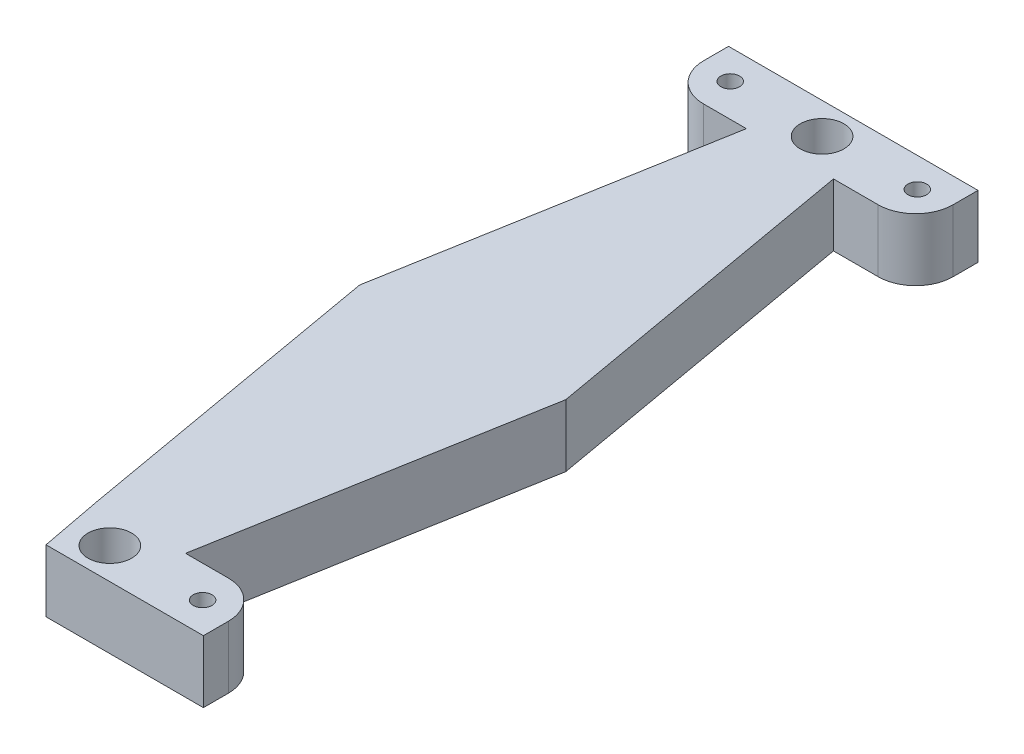
ISO-10303-21;
HEADER;
FILE_DESCRIPTION(('STEP AP214'),'2;1');
FILE_NAME('part.step','',(''),(''),'','','');
FILE_SCHEMA(('AUTOMOTIVE_DESIGN { 1 0 10303 214 1 1 1 1 }'));
ENDSEC;
DATA;
#1=APPLICATION_CONTEXT('core data for automotive mechanical design processes');
#2=APPLICATION_PROTOCOL_DEFINITION('international standard','automotive_design',2000,#1);
#3=PRODUCT_CONTEXT('',#1,'mechanical');
#4=PRODUCT('Part','Part','',(#3));
#5=PRODUCT_RELATED_PRODUCT_CATEGORY('part','',(#4));
#6=PRODUCT_DEFINITION_FORMATION('','',#4);
#7=PRODUCT_DEFINITION_CONTEXT('part definition',#1,'design');
#8=PRODUCT_DEFINITION('design','',#6,#7);
#9=PRODUCT_DEFINITION_SHAPE('','',#8);
#10=(LENGTH_UNIT() NAMED_UNIT(*) SI_UNIT(.MILLI.,.METRE.));
#11=(NAMED_UNIT(*) PLANE_ANGLE_UNIT() SI_UNIT($,.RADIAN.));
#12=(NAMED_UNIT(*) SI_UNIT($,.STERADIAN.) SOLID_ANGLE_UNIT());
#13=UNCERTAINTY_MEASURE_WITH_UNIT(LENGTH_MEASURE(1.E-05),#10,'distance_accuracy_value','');
#14=(GEOMETRIC_REPRESENTATION_CONTEXT(3) GLOBAL_UNCERTAINTY_ASSIGNED_CONTEXT((#13)) GLOBAL_UNIT_ASSIGNED_CONTEXT((#10,
#11,#12)) REPRESENTATION_CONTEXT('',''));
#15=CARTESIAN_POINT('',(0.,0.,0.));
#16=DIRECTION('',(0.,0.,1.));
#17=DIRECTION('',(1.,0.,0.));
#18=AXIS2_PLACEMENT_3D('',#15,#16,#17);
#19=CARTESIAN_POINT('',(0.,10.,0.));
#20=DIRECTION('',(0.,0.,-1.));
#21=DIRECTION('',(-1.,0.,0.));
#22=AXIS2_PLACEMENT_3D('',#19,#20,#21);
#23=PLANE('',#22);
#24=DIRECTION('',(0.,1.,0.));
#25=VECTOR('',#24,1.);
#26=CARTESIAN_POINT('',(14.7619991947761,0.,0.));
#27=LINE('',#26,#25);
#28=CARTESIAN_POINT('',(14.7619991947761,0.,0.));
#29=VERTEX_POINT('',#28);
#30=CARTESIAN_POINT('',(14.7619991947761,10.,0.));
#31=VERTEX_POINT('',#30);
#32=EDGE_CURVE('E161',#29,#31,#27,.T.);
#33=ORIENTED_EDGE('',*,*,#32,.F.);
#34=DIRECTION('',(1.,0.,0.));
#35=VECTOR('',#34,1.);
#36=CARTESIAN_POINT('',(0.,0.,0.));
#37=LINE('',#36,#35);
#38=CARTESIAN_POINT('',(40.,0.,0.));
#39=VERTEX_POINT('',#38);
#40=EDGE_CURVE('E174',#29,#39,#37,.T.);
#41=ORIENTED_EDGE('',*,*,#40,.T.);
#42=DIRECTION('',(0.,-1.,0.));
#43=VECTOR('',#42,1.);
#44=CARTESIAN_POINT('',(40.,10.,0.));
#45=LINE('',#44,#43);
#46=CARTESIAN_POINT('',(40.,10.,0.));
#47=VERTEX_POINT('',#46);
#48=EDGE_CURVE('E208',#47,#39,#45,.T.);
#49=ORIENTED_EDGE('',*,*,#48,.F.);
#50=DIRECTION('',(1.,0.,0.));
#51=VECTOR('',#50,1.);
#52=CARTESIAN_POINT('',(0.,10.,0.));
#53=LINE('',#52,#51);
#54=EDGE_CURVE('E176',#31,#47,#53,.T.);
#55=ORIENTED_EDGE('',*,*,#54,.F.);
#56=EDGE_LOOP('',(#33,#41,#49,#55));
#57=FACE_BOUND('',#56,.T.);
#58=ADVANCED_FACE('F45',(#57),#23,.F.);
#59=CARTESIAN_POINT('',(0.,10.,0.));
#60=DIRECTION('',(0.,1.,0.));
#61=DIRECTION('',(0.,0.,1.));
#62=AXIS2_PLACEMENT_3D('',#59,#60,#61);
#63=PLANE('',#62);
#64=CARTESIAN_POINT('',(20.2662361285954,10.,-118.939559740139));
#65=DIRECTION('',(0.,1.,0.));
#66=DIRECTION('',(0.,0.,1.));
#67=AXIS2_PLACEMENT_3D('',#64,#65,#66);
#68=CIRCLE('',#67,3.5);
#69=CARTESIAN_POINT('',(20.2662361285954,10.,-115.439559740139));
#70=VERTEX_POINT('',#69);
#71=EDGE_CURVE('E209',#70,#70,#68,.T.);
#72=ORIENTED_EDGE('',*,*,#71,.F.);
#73=EDGE_LOOP('',(#72));
#74=FACE_BOUND('',#73,.T.);
#75=CARTESIAN_POINT('',(35.2662361285954,10.,-119.20664977673));
#76=DIRECTION('',(0.,1.,0.));
#77=DIRECTION('',(0.,0.,1.));
#78=AXIS2_PLACEMENT_3D('',#75,#76,#77);
#79=CIRCLE('',#78,1.5);
#80=CARTESIAN_POINT('',(35.2662361285954,10.,-117.70664977673));
#81=VERTEX_POINT('',#80);
#82=EDGE_CURVE('E314',#81,#81,#79,.T.);
#83=ORIENTED_EDGE('',*,*,#82,.F.);
#84=EDGE_LOOP('',(#83));
#85=FACE_BOUND('',#84,.T.);
#86=CARTESIAN_POINT('',(5.26623612859535,10.,-119.20664977673));
#87=DIRECTION('',(0.,1.,0.));
#88=DIRECTION('',(0.,0.,1.));
#89=AXIS2_PLACEMENT_3D('',#86,#87,#88);
#90=CIRCLE('',#89,1.5);
#91=CARTESIAN_POINT('',(5.26623612859535,10.,-117.70664977673));
#92=VERTEX_POINT('',#91);
#93=EDGE_CURVE('E312',#92,#92,#90,.T.);
#94=ORIENTED_EDGE('',*,*,#93,.F.);
#95=EDGE_LOOP('',(#94));
#96=FACE_BOUND('',#95,.T.);
#97=CARTESIAN_POINT('',(20.,10.,-5.));
#98=DIRECTION('',(0.,1.,0.));
#99=DIRECTION('',(0.,0.,1.));
#100=AXIS2_PLACEMENT_3D('',#97,#98,#99);
#101=CIRCLE('',#100,3.5);
#102=CARTESIAN_POINT('',(20.,10.,-1.5));
#103=VERTEX_POINT('',#102);
#104=EDGE_CURVE('E309',#103,#103,#101,.T.);
#105=ORIENTED_EDGE('',*,*,#104,.F.);
#106=EDGE_LOOP('',(#105));
#107=FACE_BOUND('',#106,.T.);
#108=CARTESIAN_POINT('',(35.,10.,-4.87430196752037));
#109=DIRECTION('',(0.,1.,0.));
#110=DIRECTION('',(0.,0.,1.));
#111=AXIS2_PLACEMENT_3D('',#108,#109,#110);
#112=CIRCLE('',#111,1.5);
#113=CARTESIAN_POINT('',(35.,10.,-3.37430196752036));
#114=VERTEX_POINT('',#113);
#115=EDGE_CURVE('E304',#114,#114,#112,.T.);
#116=ORIENTED_EDGE('',*,*,#115,.F.);
#117=EDGE_LOOP('',(#116));
#118=FACE_BOUND('',#117,.T.);
#119=DIRECTION('',(0.173648177666927,0.,0.984807753012209));
#120=VECTOR('',#119,1.);
#121=CARTESIAN_POINT('',(14.184594073395,10.,-2.50112664553687));
#122=LINE('',#121,#120);
#123=CARTESIAN_POINT('',(3.83178406781208,10.,-61.2148298121565));
#124=VERTEX_POINT('',#123);
#125=CARTESIAN_POINT('',(12.8623403760873,10.,-10.));
#126=VERTEX_POINT('',#125);
#127=EDGE_CURVE('E296',#124,#126,#122,.T.);
#128=ORIENTED_EDGE('',*,*,#127,.T.);
#129=DIRECTION('',(0.186628294891102,0.,0.982430597826656));
#130=VECTOR('',#129,1.);
#131=CARTESIAN_POINT('',(12.8623403760873,10.,-10.));
#132=LINE('',#131,#130);
#133=EDGE_CURVE('E169',#126,#31,#132,.T.);
#134=ORIENTED_EDGE('',*,*,#133,.T.);
#135=ORIENTED_EDGE('',*,*,#54,.T.);
#136=DIRECTION('',(0.,0.,-1.));
#137=VECTOR('',#136,1.);
#138=CARTESIAN_POINT('',(40.,10.,0.));
#139=LINE('',#138,#137);
#140=CARTESIAN_POINT('',(40.,10.,-4.));
#141=VERTEX_POINT('',#140);
#142=EDGE_CURVE('E298',#47,#141,#139,.T.);
#143=ORIENTED_EDGE('',*,*,#142,.T.);
#144=CARTESIAN_POINT('',(34.,10.,-4.));
#145=DIRECTION('',(0.,1.,0.));
#146=DIRECTION('',(0.,0.,1.));
#147=AXIS2_PLACEMENT_3D('',#144,#145,#146);
#148=CIRCLE('',#147,6.);
#149=CARTESIAN_POINT('',(34.,10.,-10.));
#150=VERTEX_POINT('',#149);
#151=EDGE_CURVE('E60',#141,#150,#148,.T.);
#152=ORIENTED_EDGE('',*,*,#151,.T.);
#153=DIRECTION('',(1.,0.,0.));
#154=VECTOR('',#153,1.);
#155=CARTESIAN_POINT('',(0.,10.,-10.));
#156=LINE('',#155,#154);
#157=CARTESIAN_POINT('',(27.1376596239127,10.,-10.));
#158=VERTEX_POINT('',#157);
#159=EDGE_CURVE('E256',#158,#150,#156,.T.);
#160=ORIENTED_EDGE('',*,*,#159,.F.);
#161=DIRECTION('',(0.173648177666927,0.,-0.984807753012209));
#162=VECTOR('',#161,1.);
#163=CARTESIAN_POINT('',(24.6092583423233,10.,4.33927622097637));
#164=LINE('',#163,#162);
#165=CARTESIAN_POINT('',(36.2771953247347,10.,-61.8328826598202));
#166=VERTEX_POINT('',#165);
#167=EDGE_CURVE('E205',#158,#166,#164,.T.);
#168=ORIENTED_EDGE('',*,*,#167,.T.);
#169=DIRECTION('',(-0.173648177666934,0.,-0.984807753012208));
#170=VECTOR('',#169,1.);
#171=CARTESIAN_POINT('',(45.7573497318741,10.,-8.06825532344282));
#172=LINE('',#171,#170);
#173=CARTESIAN_POINT('',(27.0893822804109,10.,-113.939559740139));
#174=VERTEX_POINT('',#173);
#175=EDGE_CURVE('E408',#166,#174,#172,.T.);
#176=ORIENTED_EDGE('',*,*,#175,.T.);
#177=DIRECTION('',(1.,0.,0.));
#178=VECTOR('',#177,1.);
#179=CARTESIAN_POINT('',(0.,10.,-113.939559740139));
#180=LINE('',#179,#178);
#181=CARTESIAN_POINT('',(34.2662361285954,10.,-113.939559740139));
#182=VERTEX_POINT('',#181);
#183=EDGE_CURVE('E401',#174,#182,#180,.T.);
#184=ORIENTED_EDGE('',*,*,#183,.T.);
#185=CARTESIAN_POINT('',(34.2662361285954,10.,-119.939559740139));
#186=DIRECTION('',(0.,1.,0.));
#187=DIRECTION('',(0.,0.,1.));
#188=AXIS2_PLACEMENT_3D('',#185,#186,#187);
#189=CIRCLE('',#188,6.);
#190=CARTESIAN_POINT('',(40.2662361285954,10.,-119.939559740139));
#191=VERTEX_POINT('',#190);
#192=EDGE_CURVE('E242',#182,#191,#189,.T.);
#193=ORIENTED_EDGE('',*,*,#192,.T.);
#194=DIRECTION('',(0.,0.,-1.));
#195=VECTOR('',#194,1.);
#196=CARTESIAN_POINT('',(40.2662361285954,10.,0.));
#197=LINE('',#196,#195);
#198=CARTESIAN_POINT('',(40.2662361285954,10.,-123.939559740139));
#199=VERTEX_POINT('',#198);
#200=EDGE_CURVE('E398',#191,#199,#197,.T.);
#201=ORIENTED_EDGE('',*,*,#200,.T.);
#202=DIRECTION('',(1.,0.,0.));
#203=VECTOR('',#202,1.);
#204=CARTESIAN_POINT('',(0.,10.,-123.939559740139));
#205=LINE('',#204,#203);
#206=CARTESIAN_POINT('',(0.266236128595353,10.,-123.939559740139));
#207=VERTEX_POINT('',#206);
#208=EDGE_CURVE('E404',#207,#199,#205,.T.);
#209=ORIENTED_EDGE('',*,*,#208,.F.);
#210=DIRECTION('',(0.,0.,-1.));
#211=VECTOR('',#210,1.);
#212=CARTESIAN_POINT('',(0.266236128595353,10.,0.));
#213=LINE('',#212,#211);
#214=CARTESIAN_POINT('',(0.266236128595353,10.,-119.939559740139));
#215=VERTEX_POINT('',#214);
#216=EDGE_CURVE('E406',#215,#207,#213,.T.);
#217=ORIENTED_EDGE('',*,*,#216,.F.);
#218=CARTESIAN_POINT('',(6.26623612859535,10.,-119.939559740139));
#219=DIRECTION('',(0.,1.,0.));
#220=DIRECTION('',(0.,0.,1.));
#221=AXIS2_PLACEMENT_3D('',#218,#219,#220);
#222=CIRCLE('',#221,6.);
#223=CARTESIAN_POINT('',(6.26623612859535,10.,-113.939559740139));
#224=VERTEX_POINT('',#223);
#225=EDGE_CURVE('E244',#215,#224,#222,.T.);
#226=ORIENTED_EDGE('',*,*,#225,.T.);
#227=CARTESIAN_POINT('',(13.1285765046827,10.,-113.939559740139));
#228=VERTEX_POINT('',#227);
#229=EDGE_CURVE('E300',#224,#228,#180,.T.);
#230=ORIENTED_EDGE('',*,*,#229,.T.);
#231=DIRECTION('',(-0.173648177666934,0.,0.984807753012208));
#232=VECTOR('',#231,1.);
#233=CARTESIAN_POINT('',(-6.75211079261525,10.,-1.19057930947091));
#234=LINE('',#233,#232);
#235=EDGE_CURVE('E291',#228,#124,#234,.T.);
#236=ORIENTED_EDGE('',*,*,#235,.T.);
#237=EDGE_LOOP('',(#128,#134,#135,#143,#152,#160,#168,#176,#184,#193,#201,#209,#217,#226,#230,#236));
#238=FACE_BOUND('',#237,.T.);
#239=ADVANCED_FACE('F324',(#74,#85,#96,#107,#118,#238),#63,.T.);
#240=CARTESIAN_POINT('',(0.,0.,0.));
#241=DIRECTION('',(0.,1.,0.));
#242=DIRECTION('',(0.,0.,1.));
#243=AXIS2_PLACEMENT_3D('',#240,#241,#242);
#244=PLANE('',#243);
#245=CARTESIAN_POINT('',(20.2662361285954,0.,-118.939559740139));
#246=DIRECTION('',(0.,1.,0.));
#247=DIRECTION('',(0.,0.,1.));
#248=AXIS2_PLACEMENT_3D('',#245,#246,#247);
#249=CIRCLE('',#248,3.5);
#250=CARTESIAN_POINT('',(20.2662361285954,0.,-115.439559740139));
#251=VERTEX_POINT('',#250);
#252=EDGE_CURVE('E202',#251,#251,#249,.T.);
#253=ORIENTED_EDGE('',*,*,#252,.T.);
#254=EDGE_LOOP('',(#253));
#255=FACE_BOUND('',#254,.T.);
#256=CARTESIAN_POINT('',(35.2662361285954,0.,-119.20664977673));
#257=DIRECTION('',(0.,1.,0.));
#258=DIRECTION('',(0.,0.,1.));
#259=AXIS2_PLACEMENT_3D('',#256,#257,#258);
#260=CIRCLE('',#259,1.5);
#261=CARTESIAN_POINT('',(35.2662361285954,0.,-117.70664977673));
#262=VERTEX_POINT('',#261);
#263=EDGE_CURVE('E199',#262,#262,#260,.T.);
#264=ORIENTED_EDGE('',*,*,#263,.T.);
#265=EDGE_LOOP('',(#264));
#266=FACE_BOUND('',#265,.T.);
#267=CARTESIAN_POINT('',(5.26623612859535,0.,-119.20664977673));
#268=DIRECTION('',(0.,1.,0.));
#269=DIRECTION('',(0.,0.,1.));
#270=AXIS2_PLACEMENT_3D('',#267,#268,#269);
#271=CIRCLE('',#270,1.5);
#272=CARTESIAN_POINT('',(5.26623612859535,0.,-117.70664977673));
#273=VERTEX_POINT('',#272);
#274=EDGE_CURVE('E196',#273,#273,#271,.T.);
#275=ORIENTED_EDGE('',*,*,#274,.T.);
#276=EDGE_LOOP('',(#275));
#277=FACE_BOUND('',#276,.T.);
#278=CARTESIAN_POINT('',(20.,0.,-5.));
#279=DIRECTION('',(0.,1.,0.));
#280=DIRECTION('',(0.,0.,1.));
#281=AXIS2_PLACEMENT_3D('',#278,#279,#280);
#282=CIRCLE('',#281,3.5);
#283=CARTESIAN_POINT('',(20.,0.,-1.5));
#284=VERTEX_POINT('',#283);
#285=EDGE_CURVE('E193',#284,#284,#282,.T.);
#286=ORIENTED_EDGE('',*,*,#285,.T.);
#287=EDGE_LOOP('',(#286));
#288=FACE_BOUND('',#287,.T.);
#289=CARTESIAN_POINT('',(35.,0.,-4.87430196752037));
#290=DIRECTION('',(0.,1.,0.));
#291=DIRECTION('',(0.,0.,1.));
#292=AXIS2_PLACEMENT_3D('',#289,#290,#291);
#293=CIRCLE('',#292,1.5);
#294=CARTESIAN_POINT('',(35.,0.,-3.37430196752036));
#295=VERTEX_POINT('',#294);
#296=EDGE_CURVE('E190',#295,#295,#293,.T.);
#297=ORIENTED_EDGE('',*,*,#296,.T.);
#298=EDGE_LOOP('',(#297));
#299=FACE_BOUND('',#298,.T.);
#300=DIRECTION('',(0.186628294891102,0.,0.982430597826656));
#301=VECTOR('',#300,1.);
#302=CARTESIAN_POINT('',(12.8623403760873,0.,-10.));
#303=LINE('',#302,#301);
#304=CARTESIAN_POINT('',(12.8623403760873,0.,-10.));
#305=VERTEX_POINT('',#304);
#306=EDGE_CURVE('E158',#305,#29,#303,.T.);
#307=ORIENTED_EDGE('',*,*,#306,.F.);
#308=DIRECTION('',(0.173648177666927,0.,0.984807753012209));
#309=VECTOR('',#308,1.);
#310=CARTESIAN_POINT('',(14.184594073395,0.,-2.50112664553687));
#311=LINE('',#310,#309);
#312=CARTESIAN_POINT('',(3.83178406781208,0.,-61.2148298121565));
#313=VERTEX_POINT('',#312);
#314=EDGE_CURVE('E182',#313,#305,#311,.T.);
#315=ORIENTED_EDGE('',*,*,#314,.F.);
#316=DIRECTION('',(-0.173648177666934,0.,0.984807753012208));
#317=VECTOR('',#316,1.);
#318=CARTESIAN_POINT('',(-6.75211079261525,0.,-1.19057930947091));
#319=LINE('',#318,#317);
#320=CARTESIAN_POINT('',(13.1285765046827,0.,-113.939559740139));
#321=VERTEX_POINT('',#320);
#322=EDGE_CURVE('E186',#321,#313,#319,.T.);
#323=ORIENTED_EDGE('',*,*,#322,.F.);
#324=DIRECTION('',(1.,0.,0.));
#325=VECTOR('',#324,1.);
#326=CARTESIAN_POINT('',(0.,0.,-113.939559740139));
#327=LINE('',#326,#325);
#328=CARTESIAN_POINT('',(6.26623612859535,0.,-113.939559740139));
#329=VERTEX_POINT('',#328);
#330=EDGE_CURVE('E273',#329,#321,#327,.T.);
#331=ORIENTED_EDGE('',*,*,#330,.F.);
#332=CARTESIAN_POINT('',(6.26623612859535,0.,-119.939559740139));
#333=DIRECTION('',(0.,1.,0.));
#334=DIRECTION('',(0.,0.,1.));
#335=AXIS2_PLACEMENT_3D('',#332,#333,#334);
#336=CIRCLE('',#335,6.);
#337=CARTESIAN_POINT('',(0.266236128595353,0.,-119.939559740139));
#338=VERTEX_POINT('',#337);
#339=EDGE_CURVE('E237',#329,#338,#336,.F.);
#340=ORIENTED_EDGE('',*,*,#339,.T.);
#341=DIRECTION('',(0.,0.,-1.));
#342=VECTOR('',#341,1.);
#343=CARTESIAN_POINT('',(0.266236128595353,0.,0.));
#344=LINE('',#343,#342);
#345=CARTESIAN_POINT('',(0.266236128595353,0.,-123.939559740139));
#346=VERTEX_POINT('',#345);
#347=EDGE_CURVE('E278',#338,#346,#344,.T.);
#348=ORIENTED_EDGE('',*,*,#347,.T.);
#349=DIRECTION('',(1.,0.,0.));
#350=VECTOR('',#349,1.);
#351=CARTESIAN_POINT('',(0.,0.,-123.939559740139));
#352=LINE('',#351,#350);
#353=CARTESIAN_POINT('',(40.2662361285954,0.,-123.939559740139));
#354=VERTEX_POINT('',#353);
#355=EDGE_CURVE('E275',#346,#354,#352,.T.);
#356=ORIENTED_EDGE('',*,*,#355,.T.);
#357=DIRECTION('',(0.,0.,-1.));
#358=VECTOR('',#357,1.);
#359=CARTESIAN_POINT('',(40.2662361285954,0.,0.));
#360=LINE('',#359,#358);
#361=CARTESIAN_POINT('',(40.2662361285954,0.,-119.939559740139));
#362=VERTEX_POINT('',#361);
#363=EDGE_CURVE('E272',#362,#354,#360,.T.);
#364=ORIENTED_EDGE('',*,*,#363,.F.);
#365=CARTESIAN_POINT('',(34.2662361285954,0.,-119.939559740139));
#366=DIRECTION('',(0.,1.,0.));
#367=DIRECTION('',(0.,0.,1.));
#368=AXIS2_PLACEMENT_3D('',#365,#366,#367);
#369=CIRCLE('',#368,6.);
#370=CARTESIAN_POINT('',(34.2662361285954,0.,-113.939559740139));
#371=VERTEX_POINT('',#370);
#372=EDGE_CURVE('E235',#362,#371,#369,.F.);
#373=ORIENTED_EDGE('',*,*,#372,.T.);
#374=CARTESIAN_POINT('',(27.0893822804109,0.,-113.939559740139));
#375=VERTEX_POINT('',#374);
#376=EDGE_CURVE('E265',#375,#371,#327,.T.);
#377=ORIENTED_EDGE('',*,*,#376,.F.);
#378=DIRECTION('',(-0.173648177666934,0.,-0.984807753012208));
#379=VECTOR('',#378,1.);
#380=CARTESIAN_POINT('',(45.7573497318741,0.,-8.06825532344282));
#381=LINE('',#380,#379);
#382=CARTESIAN_POINT('',(36.2771953247347,0.,-61.8328826598202));
#383=VERTEX_POINT('',#382);
#384=EDGE_CURVE('E261',#383,#375,#381,.T.);
#385=ORIENTED_EDGE('',*,*,#384,.F.);
#386=DIRECTION('',(0.173648177666927,0.,-0.984807753012209));
#387=VECTOR('',#386,1.);
#388=CARTESIAN_POINT('',(24.6092583423233,0.,4.33927622097637));
#389=LINE('',#388,#387);
#390=CARTESIAN_POINT('',(27.1376596239127,0.,-10.));
#391=VERTEX_POINT('',#390);
#392=EDGE_CURVE('E177',#391,#383,#389,.T.);
#393=ORIENTED_EDGE('',*,*,#392,.F.);
#394=DIRECTION('',(1.,0.,0.));
#395=VECTOR('',#394,1.);
#396=CARTESIAN_POINT('',(0.,0.,-10.));
#397=LINE('',#396,#395);
#398=CARTESIAN_POINT('',(34.,0.,-10.));
#399=VERTEX_POINT('',#398);
#400=EDGE_CURVE('E184',#391,#399,#397,.T.);
#401=ORIENTED_EDGE('',*,*,#400,.T.);
#402=CARTESIAN_POINT('',(34.,0.,-4.));
#403=DIRECTION('',(0.,1.,0.));
#404=DIRECTION('',(0.,0.,1.));
#405=AXIS2_PLACEMENT_3D('',#402,#403,#404);
#406=CIRCLE('',#405,6.);
#407=CARTESIAN_POINT('',(40.,0.,-4.));
#408=VERTEX_POINT('',#407);
#409=EDGE_CURVE('E233',#399,#408,#406,.F.);
#410=ORIENTED_EDGE('',*,*,#409,.T.);
#411=DIRECTION('',(0.,0.,-1.));
#412=VECTOR('',#411,1.);
#413=CARTESIAN_POINT('',(40.,0.,0.));
#414=LINE('',#413,#412);
#415=EDGE_CURVE('E181',#39,#408,#414,.T.);
#416=ORIENTED_EDGE('',*,*,#415,.F.);
#417=ORIENTED_EDGE('',*,*,#40,.F.);
#418=EDGE_LOOP('',(#307,#315,#323,#331,#340,#348,#356,#364,#373,#377,#385,#393,#401,#410,#416,#417));
#419=FACE_BOUND('',#418,.T.);
#420=ADVANCED_FACE('F180',(#255,#266,#277,#288,#299,#419),#244,.F.);
#421=CARTESIAN_POINT('',(24.6092583423233,10.,4.33927622097637));
#422=DIRECTION('',(-0.984807753012209,0.,-0.173648177666927));
#423=DIRECTION('',(-0.173648177666927,0.,0.984807753012209));
#424=AXIS2_PLACEMENT_3D('',#421,#422,#423);
#425=PLANE('',#424);
#426=ORIENTED_EDGE('',*,*,#392,.T.);
#427=DIRECTION('',(0.,-1.,0.));
#428=VECTOR('',#427,1.);
#429=CARTESIAN_POINT('',(36.2771953247347,10.,-61.8328826598202));
#430=LINE('',#429,#428);
#431=EDGE_CURVE('E227',#166,#383,#430,.T.);
#432=ORIENTED_EDGE('',*,*,#431,.F.);
#433=ORIENTED_EDGE('',*,*,#167,.F.);
#434=DIRECTION('',(0.,-1.,0.));
#435=VECTOR('',#434,1.);
#436=CARTESIAN_POINT('',(27.1376596239127,10.,-10.));
#437=LINE('',#436,#435);
#438=EDGE_CURVE('E206',#158,#391,#437,.T.);
#439=ORIENTED_EDGE('',*,*,#438,.T.);
#440=EDGE_LOOP('',(#426,#432,#433,#439));
#441=FACE_BOUND('',#440,.T.);
#442=ADVANCED_FACE('F343',(#441),#425,.F.);
#443=CARTESIAN_POINT('',(45.7573497318741,10.,-8.06825532344282));
#444=DIRECTION('',(-0.984807753012208,0.,0.173648177666934));
#445=DIRECTION('',(0.173648177666934,0.,0.984807753012208));
#446=AXIS2_PLACEMENT_3D('',#443,#444,#445);
#447=PLANE('',#446);
#448=ORIENTED_EDGE('',*,*,#384,.T.);
#449=DIRECTION('',(0.,-1.,0.));
#450=VECTOR('',#449,1.);
#451=CARTESIAN_POINT('',(27.0893822804109,10.,-113.939559740139));
#452=LINE('',#451,#450);
#453=EDGE_CURVE('E224',#174,#375,#452,.T.);
#454=ORIENTED_EDGE('',*,*,#453,.F.);
#455=ORIENTED_EDGE('',*,*,#175,.F.);
#456=ORIENTED_EDGE('',*,*,#431,.T.);
#457=EDGE_LOOP('',(#448,#454,#455,#456));
#458=FACE_BOUND('',#457,.T.);
#459=ADVANCED_FACE('F350',(#458),#447,.F.);
#460=CARTESIAN_POINT('',(0.,10.,-113.939559740139));
#461=DIRECTION('',(0.,0.,-1.));
#462=DIRECTION('',(-1.,0.,0.));
#463=AXIS2_PLACEMENT_3D('',#460,#461,#462);
#464=PLANE('',#463);
#465=ORIENTED_EDGE('',*,*,#376,.T.);
#466=DIRECTION('',(0.,-1.,0.));
#467=VECTOR('',#466,1.);
#468=CARTESIAN_POINT('',(34.2662361285954,10.,-113.939559740139));
#469=LINE('',#468,#467);
#470=EDGE_CURVE('E249',#371,#182,#469,.F.);
#471=ORIENTED_EDGE('',*,*,#470,.T.);
#472=ORIENTED_EDGE('',*,*,#183,.F.);
#473=ORIENTED_EDGE('',*,*,#453,.T.);
#474=EDGE_LOOP('',(#465,#471,#472,#473));
#475=FACE_BOUND('',#474,.T.);
#476=ADVANCED_FACE('F369',(#475),#464,.F.);
#477=CARTESIAN_POINT('',(40.2662361285954,10.,0.));
#478=DIRECTION('',(-1.,0.,0.));
#479=DIRECTION('',(0.,0.,1.));
#480=AXIS2_PLACEMENT_3D('',#477,#478,#479);
#481=PLANE('',#480);
#482=ORIENTED_EDGE('',*,*,#200,.F.);
#483=DIRECTION('',(0.,-1.,0.));
#484=VECTOR('',#483,1.);
#485=CARTESIAN_POINT('',(40.2662361285954,10.,-119.939559740139));
#486=LINE('',#485,#484);
#487=EDGE_CURVE('E246',#191,#362,#486,.T.);
#488=ORIENTED_EDGE('',*,*,#487,.T.);
#489=ORIENTED_EDGE('',*,*,#363,.T.);
#490=DIRECTION('',(0.,-1.,0.));
#491=VECTOR('',#490,1.);
#492=CARTESIAN_POINT('',(40.2662361285954,10.,-123.939559740139));
#493=LINE('',#492,#491);
#494=EDGE_CURVE('E221',#199,#354,#493,.T.);
#495=ORIENTED_EDGE('',*,*,#494,.F.);
#496=EDGE_LOOP('',(#482,#488,#489,#495));
#497=FACE_BOUND('',#496,.T.);
#498=ADVANCED_FACE('F376',(#497),#481,.F.);
#499=CARTESIAN_POINT('',(0.,10.,-123.939559740139));
#500=DIRECTION('',(0.,0.,-1.));
#501=DIRECTION('',(-1.,0.,0.));
#502=AXIS2_PLACEMENT_3D('',#499,#500,#501);
#503=PLANE('',#502);
#504=ORIENTED_EDGE('',*,*,#355,.F.);
#505=DIRECTION('',(0.,-1.,0.));
#506=VECTOR('',#505,1.);
#507=CARTESIAN_POINT('',(0.266236128595353,10.,-123.939559740139));
#508=LINE('',#507,#506);
#509=EDGE_CURVE('E218',#207,#346,#508,.T.);
#510=ORIENTED_EDGE('',*,*,#509,.F.);
#511=ORIENTED_EDGE('',*,*,#208,.T.);
#512=ORIENTED_EDGE('',*,*,#494,.T.);
#513=EDGE_LOOP('',(#504,#510,#511,#512));
#514=FACE_BOUND('',#513,.T.);
#515=ADVANCED_FACE('F372',(#514),#503,.T.);
#516=CARTESIAN_POINT('',(0.266236128595353,10.,0.));
#517=DIRECTION('',(-1.,0.,0.));
#518=DIRECTION('',(0.,0.,1.));
#519=AXIS2_PLACEMENT_3D('',#516,#517,#518);
#520=PLANE('',#519);
#521=ORIENTED_EDGE('',*,*,#347,.F.);
#522=DIRECTION('',(0.,-1.,0.));
#523=VECTOR('',#522,1.);
#524=CARTESIAN_POINT('',(0.266236128595353,10.,-119.939559740139));
#525=LINE('',#524,#523);
#526=EDGE_CURVE('E239',#338,#215,#525,.F.);
#527=ORIENTED_EDGE('',*,*,#526,.T.);
#528=ORIENTED_EDGE('',*,*,#216,.T.);
#529=ORIENTED_EDGE('',*,*,#509,.T.);
#530=EDGE_LOOP('',(#521,#527,#528,#529));
#531=FACE_BOUND('',#530,.T.);
#532=ADVANCED_FACE('F368',(#531),#520,.T.);
#533=ORIENTED_EDGE('',*,*,#229,.F.);
#534=DIRECTION('',(0.,-1.,0.));
#535=VECTOR('',#534,1.);
#536=CARTESIAN_POINT('',(6.26623612859535,0.,-113.939559740139));
#537=LINE('',#536,#535);
#538=EDGE_CURVE('E230',#224,#329,#537,.T.);
#539=ORIENTED_EDGE('',*,*,#538,.T.);
#540=ORIENTED_EDGE('',*,*,#330,.T.);
#541=DIRECTION('',(0.,-1.,0.));
#542=VECTOR('',#541,1.);
#543=CARTESIAN_POINT('',(13.1285765046827,10.,-113.939559740139));
#544=LINE('',#543,#542);
#545=EDGE_CURVE('E215',#228,#321,#544,.T.);
#546=ORIENTED_EDGE('',*,*,#545,.F.);
#547=EDGE_LOOP('',(#533,#539,#540,#546));
#548=FACE_BOUND('',#547,.T.);
#549=ADVANCED_FACE('F287',(#548),#464,.F.);
#550=CARTESIAN_POINT('',(-6.75211079261525,10.,-1.19057930947091));
#551=DIRECTION('',(0.984807753012208,0.,0.173648177666934));
#552=DIRECTION('',(0.173648177666934,0.,-0.984807753012208));
#553=AXIS2_PLACEMENT_3D('',#550,#551,#552);
#554=PLANE('',#553);
#555=ORIENTED_EDGE('',*,*,#322,.T.);
#556=DIRECTION('',(0.,-1.,0.));
#557=VECTOR('',#556,1.);
#558=CARTESIAN_POINT('',(3.83178406781208,10.,-61.2148298121565));
#559=LINE('',#558,#557);
#560=EDGE_CURVE('E212',#124,#313,#559,.T.);
#561=ORIENTED_EDGE('',*,*,#560,.F.);
#562=ORIENTED_EDGE('',*,*,#235,.F.);
#563=ORIENTED_EDGE('',*,*,#545,.T.);
#564=EDGE_LOOP('',(#555,#561,#562,#563));
#565=FACE_BOUND('',#564,.T.);
#566=ADVANCED_FACE('F290',(#565),#554,.F.);
#567=CARTESIAN_POINT('',(14.184594073395,10.,-2.50112664553687));
#568=DIRECTION('',(0.984807753012208,0.,-0.173648177666927));
#569=DIRECTION('',(-0.173648177666927,0.,-0.984807753012209));
#570=AXIS2_PLACEMENT_3D('',#567,#568,#569);
#571=PLANE('',#570);
#572=ORIENTED_EDGE('',*,*,#314,.T.);
#573=DIRECTION('',(0.,-1.,0.));
#574=VECTOR('',#573,1.);
#575=CARTESIAN_POINT('',(12.8623403760873,10.,-10.));
#576=LINE('',#575,#574);
#577=EDGE_CURVE('E164',#126,#305,#576,.T.);
#578=ORIENTED_EDGE('',*,*,#577,.F.);
#579=ORIENTED_EDGE('',*,*,#127,.F.);
#580=ORIENTED_EDGE('',*,*,#560,.T.);
#581=EDGE_LOOP('',(#572,#578,#579,#580));
#582=FACE_BOUND('',#581,.T.);
#583=ADVANCED_FACE('F293',(#582),#571,.F.);
#584=CARTESIAN_POINT('',(40.,10.,0.));
#585=DIRECTION('',(-1.,0.,0.));
#586=DIRECTION('',(0.,0.,1.));
#587=AXIS2_PLACEMENT_3D('',#584,#585,#586);
#588=PLANE('',#587);
#589=ORIENTED_EDGE('',*,*,#415,.T.);
#590=DIRECTION('',(0.,-1.,0.));
#591=VECTOR('',#590,1.);
#592=CARTESIAN_POINT('',(40.,10.,-4.));
#593=LINE('',#592,#591);
#594=EDGE_CURVE('E11',#408,#141,#593,.F.);
#595=ORIENTED_EDGE('',*,*,#594,.T.);
#596=ORIENTED_EDGE('',*,*,#142,.F.);
#597=ORIENTED_EDGE('',*,*,#48,.T.);
#598=EDGE_LOOP('',(#589,#595,#596,#597));
#599=FACE_BOUND('',#598,.T.);
#600=ADVANCED_FACE('F361',(#599),#588,.F.);
#601=CARTESIAN_POINT('',(35.2662361285954,10.,-119.20664977673));
#602=DIRECTION('',(0.,-1.,0.));
#603=DIRECTION('',(0.,0.,-1.));
#604=AXIS2_PLACEMENT_3D('',#601,#602,#603);
#605=CYLINDRICAL_SURFACE('',#604,1.5);
#606=ORIENTED_EDGE('',*,*,#82,.T.);
#607=EDGE_LOOP('',(#606));
#608=FACE_BOUND('',#607,.T.);
#609=ORIENTED_EDGE('',*,*,#263,.F.);
#610=EDGE_LOOP('',(#609));
#611=FACE_BOUND('',#610,.T.);
#612=ADVANCED_FACE('F424',(#608,#611),#605,.F.);
#613=CARTESIAN_POINT('',(5.26623612859535,10.,-119.20664977673));
#614=DIRECTION('',(0.,-1.,0.));
#615=DIRECTION('',(0.,0.,-1.));
#616=AXIS2_PLACEMENT_3D('',#613,#614,#615);
#617=CYLINDRICAL_SURFACE('',#616,1.5);
#618=ORIENTED_EDGE('',*,*,#93,.T.);
#619=EDGE_LOOP('',(#618));
#620=FACE_BOUND('',#619,.T.);
#621=ORIENTED_EDGE('',*,*,#274,.F.);
#622=EDGE_LOOP('',(#621));
#623=FACE_BOUND('',#622,.T.);
#624=ADVANCED_FACE('F429',(#620,#623),#617,.F.);
#625=CARTESIAN_POINT('',(20.,10.,-5.));
#626=DIRECTION('',(0.,-1.,0.));
#627=DIRECTION('',(0.,0.,-1.));
#628=AXIS2_PLACEMENT_3D('',#625,#626,#627);
#629=CYLINDRICAL_SURFACE('',#628,3.5);
#630=ORIENTED_EDGE('',*,*,#104,.T.);
#631=EDGE_LOOP('',(#630));
#632=FACE_BOUND('',#631,.T.);
#633=ORIENTED_EDGE('',*,*,#285,.F.);
#634=EDGE_LOOP('',(#633));
#635=FACE_BOUND('',#634,.T.);
#636=ADVANCED_FACE('F338',(#632,#635),#629,.F.);
#637=CARTESIAN_POINT('',(35.,10.,-4.87430196752037));
#638=DIRECTION('',(0.,-1.,0.));
#639=DIRECTION('',(0.,0.,-1.));
#640=AXIS2_PLACEMENT_3D('',#637,#638,#639);
#641=CYLINDRICAL_SURFACE('',#640,1.5);
#642=ORIENTED_EDGE('',*,*,#115,.T.);
#643=EDGE_LOOP('',(#642));
#644=FACE_BOUND('',#643,.T.);
#645=ORIENTED_EDGE('',*,*,#296,.F.);
#646=EDGE_LOOP('',(#645));
#647=FACE_BOUND('',#646,.T.);
#648=ADVANCED_FACE('F335',(#644,#647),#641,.F.);
#649=CARTESIAN_POINT('',(0.,10.,-10.));
#650=DIRECTION('',(0.,0.,-1.));
#651=DIRECTION('',(-1.,0.,0.));
#652=AXIS2_PLACEMENT_3D('',#649,#650,#651);
#653=PLANE('',#652);
#654=ORIENTED_EDGE('',*,*,#159,.T.);
#655=DIRECTION('',(0.,-1.,0.));
#656=VECTOR('',#655,1.);
#657=CARTESIAN_POINT('',(34.,0.,-10.));
#658=LINE('',#657,#656);
#659=EDGE_CURVE('E53',#150,#399,#658,.T.);
#660=ORIENTED_EDGE('',*,*,#659,.T.);
#661=ORIENTED_EDGE('',*,*,#400,.F.);
#662=ORIENTED_EDGE('',*,*,#438,.F.);
#663=EDGE_LOOP('',(#654,#660,#661,#662));
#664=FACE_BOUND('',#663,.T.);
#665=ADVANCED_FACE('F255',(#664),#653,.T.);
#666=CARTESIAN_POINT('',(20.2662361285954,10.,-118.939559740139));
#667=DIRECTION('',(0.,-1.,0.));
#668=DIRECTION('',(0.,0.,-1.));
#669=AXIS2_PLACEMENT_3D('',#666,#667,#668);
#670=CYLINDRICAL_SURFACE('',#669,3.5);
#671=ORIENTED_EDGE('',*,*,#71,.T.);
#672=EDGE_LOOP('',(#671));
#673=FACE_BOUND('',#672,.T.);
#674=ORIENTED_EDGE('',*,*,#252,.F.);
#675=EDGE_LOOP('',(#674));
#676=FACE_BOUND('',#675,.T.);
#677=ADVANCED_FACE('F321',(#673,#676),#670,.F.);
#678=CARTESIAN_POINT('',(6.26623612859535,10.,-119.939559740139));
#679=DIRECTION('',(0.,1.,0.));
#680=DIRECTION('',(0.,0.,1.));
#681=AXIS2_PLACEMENT_3D('',#678,#679,#680);
#682=CYLINDRICAL_SURFACE('',#681,6.);
#683=ORIENTED_EDGE('',*,*,#225,.F.);
#684=ORIENTED_EDGE('',*,*,#526,.F.);
#685=ORIENTED_EDGE('',*,*,#339,.F.);
#686=ORIENTED_EDGE('',*,*,#538,.F.);
#687=EDGE_LOOP('',(#683,#684,#685,#686));
#688=FACE_BOUND('',#687,.T.);
#689=ADVANCED_FACE('F384',(#688),#682,.T.);
#690=CARTESIAN_POINT('',(34.2662361285954,10.,-119.939559740139));
#691=DIRECTION('',(0.,-1.,0.));
#692=DIRECTION('',(0.,0.,-1.));
#693=AXIS2_PLACEMENT_3D('',#690,#691,#692);
#694=CYLINDRICAL_SURFACE('',#693,6.);
#695=ORIENTED_EDGE('',*,*,#192,.F.);
#696=ORIENTED_EDGE('',*,*,#470,.F.);
#697=ORIENTED_EDGE('',*,*,#372,.F.);
#698=ORIENTED_EDGE('',*,*,#487,.F.);
#699=EDGE_LOOP('',(#695,#696,#697,#698));
#700=FACE_BOUND('',#699,.T.);
#701=ADVANCED_FACE('F386',(#700),#694,.T.);
#702=CARTESIAN_POINT('',(34.,10.,-4.));
#703=DIRECTION('',(0.,1.,0.));
#704=DIRECTION('',(0.,0.,1.));
#705=AXIS2_PLACEMENT_3D('',#702,#703,#704);
#706=CYLINDRICAL_SURFACE('',#705,6.);
#707=ORIENTED_EDGE('',*,*,#151,.F.);
#708=ORIENTED_EDGE('',*,*,#594,.F.);
#709=ORIENTED_EDGE('',*,*,#409,.F.);
#710=ORIENTED_EDGE('',*,*,#659,.F.);
#711=EDGE_LOOP('',(#707,#708,#709,#710));
#712=FACE_BOUND('',#711,.T.);
#713=ADVANCED_FACE('F47',(#712),#706,.T.);
#714=CARTESIAN_POINT('',(12.8623403760873,0.,-10.));
#715=DIRECTION('',(-0.982430597826655,0.,0.186628294891102));
#716=DIRECTION('',(0.186628294891102,0.,0.982430597826656));
#717=AXIS2_PLACEMENT_3D('',#714,#715,#716);
#718=PLANE('',#717);
#719=ORIENTED_EDGE('',*,*,#133,.F.);
#720=ORIENTED_EDGE('',*,*,#577,.T.);
#721=ORIENTED_EDGE('',*,*,#306,.T.);
#722=ORIENTED_EDGE('',*,*,#32,.T.);
#723=EDGE_LOOP('',(#719,#720,#721,#722));
#724=FACE_BOUND('',#723,.T.);
#725=ADVANCED_FACE('F160',(#724),#718,.T.);
#726=CLOSED_SHELL('',(#58,#239,#420,#442,#459,#476,#498,#515,#532,#549,#566,#583,#600,#612,#624,
#636,#648,#665,#677,#689,#701,#713,#725));
#727=MANIFOLD_SOLID_BREP('B2',#726);
#728=ADVANCED_BREP_SHAPE_REPRESENTATION('',(#18,#727),#14);
#729=SHAPE_DEFINITION_REPRESENTATION(#9,#728);
ENDSEC;
END-ISO-10303-21;
